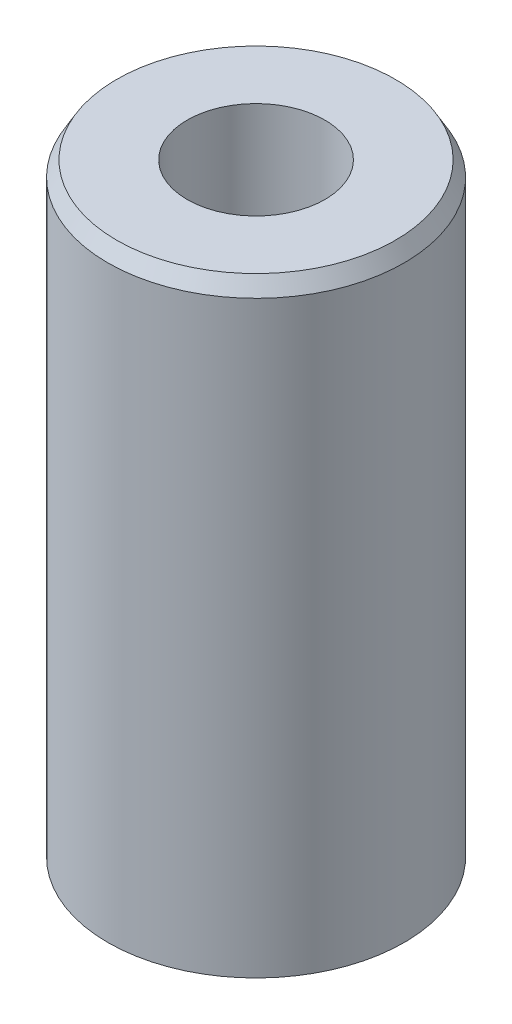
ISO-10303-21;
HEADER;
FILE_DESCRIPTION(('STEP AP214'),'2;1');
FILE_NAME('part.step','',(''),(''),'','','');
FILE_SCHEMA(('AUTOMOTIVE_DESIGN { 1 0 10303 214 1 1 1 1 }'));
ENDSEC;
DATA;
#1=APPLICATION_CONTEXT('core data for automotive mechanical design processes');
#2=APPLICATION_PROTOCOL_DEFINITION('international standard','automotive_design',2000,#1);
#3=PRODUCT_CONTEXT('',#1,'mechanical');
#4=PRODUCT('Part','Part','',(#3));
#5=PRODUCT_RELATED_PRODUCT_CATEGORY('part','',(#4));
#6=PRODUCT_DEFINITION_FORMATION('','',#4);
#7=PRODUCT_DEFINITION_CONTEXT('part definition',#1,'design');
#8=PRODUCT_DEFINITION('design','',#6,#7);
#9=PRODUCT_DEFINITION_SHAPE('','',#8);
#10=(LENGTH_UNIT() NAMED_UNIT(*) SI_UNIT(.MILLI.,.METRE.));
#11=(NAMED_UNIT(*) PLANE_ANGLE_UNIT() SI_UNIT($,.RADIAN.));
#12=(NAMED_UNIT(*) SI_UNIT($,.STERADIAN.) SOLID_ANGLE_UNIT());
#13=UNCERTAINTY_MEASURE_WITH_UNIT(LENGTH_MEASURE(1.E-05),#10,'distance_accuracy_value','');
#14=(GEOMETRIC_REPRESENTATION_CONTEXT(3) GLOBAL_UNCERTAINTY_ASSIGNED_CONTEXT((#13)) GLOBAL_UNIT_ASSIGNED_CONTEXT((#10,
#11,#12)) REPRESENTATION_CONTEXT('',''));
#15=CARTESIAN_POINT('',(0.,0.,0.));
#16=DIRECTION('',(0.,0.,1.));
#17=DIRECTION('',(1.,0.,0.));
#18=AXIS2_PLACEMENT_3D('',#15,#16,#17);
#19=CARTESIAN_POINT('',(0.,165.38790708456,0.));
#20=DIRECTION('',(0.,-1.,0.));
#21=DIRECTION('',(0.,0.,-1.));
#22=AXIS2_PLACEMENT_3D('',#19,#20,#21);
#23=CYLINDRICAL_SURFACE('',#22,40.);
#24=CARTESIAN_POINT('',(0.,161.27810933398,0.));
#25=DIRECTION('',(0.,1.,0.));
#26=DIRECTION('',(0.,0.,1.));
#27=AXIS2_PLACEMENT_3D('',#24,#25,#26);
#28=CIRCLE('',#27,40.);
#29=CARTESIAN_POINT('',(0.,161.27810933398,40.));
#30=VERTEX_POINT('',#29);
#31=EDGE_CURVE('E50',#30,#30,#28,.F.);
#32=ORIENTED_EDGE('',*,*,#31,.T.);
#33=EDGE_LOOP('',(#32));
#34=FACE_BOUND('',#33,.T.);
#35=CARTESIAN_POINT('',(0.,2.3727928376123,0.));
#36=DIRECTION('',(0.,1.,0.));
#37=DIRECTION('',(0.,0.,1.));
#38=AXIS2_PLACEMENT_3D('',#35,#36,#37);
#39=CIRCLE('',#38,40.);
#40=CARTESIAN_POINT('',(0.,2.3727928376123,40.));
#41=VERTEX_POINT('',#40);
#42=EDGE_CURVE('E51',#41,#41,#39,.T.);
#43=ORIENTED_EDGE('',*,*,#42,.T.);
#44=EDGE_LOOP('',(#43));
#45=FACE_BOUND('',#44,.T.);
#46=ADVANCED_FACE('F39',(#34,#45),#23,.T.);
#47=CARTESIAN_POINT('',(0.,165.38790708456,0.));
#48=DIRECTION('',(0.,1.,0.));
#49=DIRECTION('',(0.,0.,1.));
#50=AXIS2_PLACEMENT_3D('',#47,#48,#49);
#51=PLANE('',#50);
#52=CARTESIAN_POINT('',(0.,165.38790708456,0.));
#53=DIRECTION('',(0.,1.,0.));
#54=DIRECTION('',(0.,0.,1.));
#55=AXIS2_PLACEMENT_3D('',#52,#53,#54);
#56=CIRCLE('',#55,37.6272071623878);
#57=CARTESIAN_POINT('',(0.,165.38790708456,37.6272071623878));
#58=VERTEX_POINT('',#57);
#59=EDGE_CURVE('E54',#58,#58,#56,.T.);
#60=ORIENTED_EDGE('',*,*,#59,.T.);
#61=EDGE_LOOP('',(#60));
#62=FACE_BOUND('',#61,.T.);
#63=CARTESIAN_POINT('',(0.,165.38790708456,0.));
#64=DIRECTION('',(0.,1.,0.));
#65=DIRECTION('',(0.,0.,1.));
#66=AXIS2_PLACEMENT_3D('',#63,#64,#65);
#67=CIRCLE('',#66,18.5968488522917);
#68=CARTESIAN_POINT('',(0.,165.38790708456,18.5968488522917));
#69=VERTEX_POINT('',#68);
#70=EDGE_CURVE('E58',#69,#69,#67,.T.);
#71=ORIENTED_EDGE('',*,*,#70,.F.);
#72=EDGE_LOOP('',(#71));
#73=FACE_BOUND('',#72,.T.);
#74=ADVANCED_FACE('F69',(#62,#73),#51,.T.);
#75=CARTESIAN_POINT('',(0.,0.,0.));
#76=DIRECTION('',(0.,1.,0.));
#77=DIRECTION('',(0.,0.,1.));
#78=AXIS2_PLACEMENT_3D('',#75,#76,#77);
#79=PLANE('',#78);
#80=CARTESIAN_POINT('',(0.,0.,0.));
#81=DIRECTION('',(0.,1.,0.));
#82=DIRECTION('',(0.,0.,1.));
#83=AXIS2_PLACEMENT_3D('',#80,#81,#82);
#84=CIRCLE('',#83,35.8902022494199);
#85=CARTESIAN_POINT('',(0.,0.,35.8902022494199));
#86=VERTEX_POINT('',#85);
#87=EDGE_CURVE('E10',#86,#86,#84,.F.);
#88=ORIENTED_EDGE('',*,*,#87,.T.);
#89=EDGE_LOOP('',(#88));
#90=FACE_BOUND('',#89,.T.);
#91=CARTESIAN_POINT('',(0.,0.,0.));
#92=DIRECTION('',(0.,1.,0.));
#93=DIRECTION('',(0.,0.,1.));
#94=AXIS2_PLACEMENT_3D('',#91,#92,#93);
#95=CIRCLE('',#94,18.5968488522917);
#96=CARTESIAN_POINT('',(0.,0.,18.5968488522917));
#97=VERTEX_POINT('',#96);
#98=EDGE_CURVE('E63',#97,#97,#95,.T.);
#99=ORIENTED_EDGE('',*,*,#98,.T.);
#100=EDGE_LOOP('',(#99));
#101=FACE_BOUND('',#100,.T.);
#102=ADVANCED_FACE('F75',(#90,#101),#79,.F.);
#103=CARTESIAN_POINT('',(0.,165.38790708456,0.));
#104=DIRECTION('',(0.,-1.,0.));
#105=DIRECTION('',(0.,0.,-1.));
#106=AXIS2_PLACEMENT_3D('',#103,#104,#105);
#107=CYLINDRICAL_SURFACE('',#106,18.5968488522917);
#108=ORIENTED_EDGE('',*,*,#70,.T.);
#109=EDGE_LOOP('',(#108));
#110=FACE_BOUND('',#109,.T.);
#111=ORIENTED_EDGE('',*,*,#98,.F.);
#112=EDGE_LOOP('',(#111));
#113=FACE_BOUND('',#112,.T.);
#114=ADVANCED_FACE('F70',(#110,#113),#107,.F.);
#115=CARTESIAN_POINT('',(0.,165.38790708456,0.));
#116=DIRECTION('',(0.,-1.,0.));
#117=DIRECTION('',(0.,0.,-1.));
#118=AXIS2_PLACEMENT_3D('',#115,#116,#117);
#119=CONICAL_SURFACE('',#118,37.6272071623878,0.523598775598295);
#120=ORIENTED_EDGE('',*,*,#31,.F.);
#121=EDGE_LOOP('',(#120));
#122=FACE_BOUND('',#121,.T.);
#123=ORIENTED_EDGE('',*,*,#59,.F.);
#124=EDGE_LOOP('',(#123));
#125=FACE_BOUND('',#124,.T.);
#126=ADVANCED_FACE('F81',(#122,#125),#119,.T.);
#127=CARTESIAN_POINT('',(0.,2.3727928376123,0.));
#128=DIRECTION('',(0.,1.,0.));
#129=DIRECTION('',(0.,0.,1.));
#130=AXIS2_PLACEMENT_3D('',#127,#128,#129);
#131=CONICAL_SURFACE('',#130,40.,1.0471975511966);
#132=ORIENTED_EDGE('',*,*,#87,.F.);
#133=EDGE_LOOP('',(#132));
#134=FACE_BOUND('',#133,.T.);
#135=ORIENTED_EDGE('',*,*,#42,.F.);
#136=EDGE_LOOP('',(#135));
#137=FACE_BOUND('',#136,.T.);
#138=ADVANCED_FACE('F45',(#134,#137),#131,.T.);
#139=CLOSED_SHELL('',(#46,#74,#102,#114,#126,#138));
#140=MANIFOLD_SOLID_BREP('B2',#139);
#141=ADVANCED_BREP_SHAPE_REPRESENTATION('',(#18,#140),#14);
#142=SHAPE_DEFINITION_REPRESENTATION(#9,#141);
ENDSEC;
END-ISO-10303-21;
